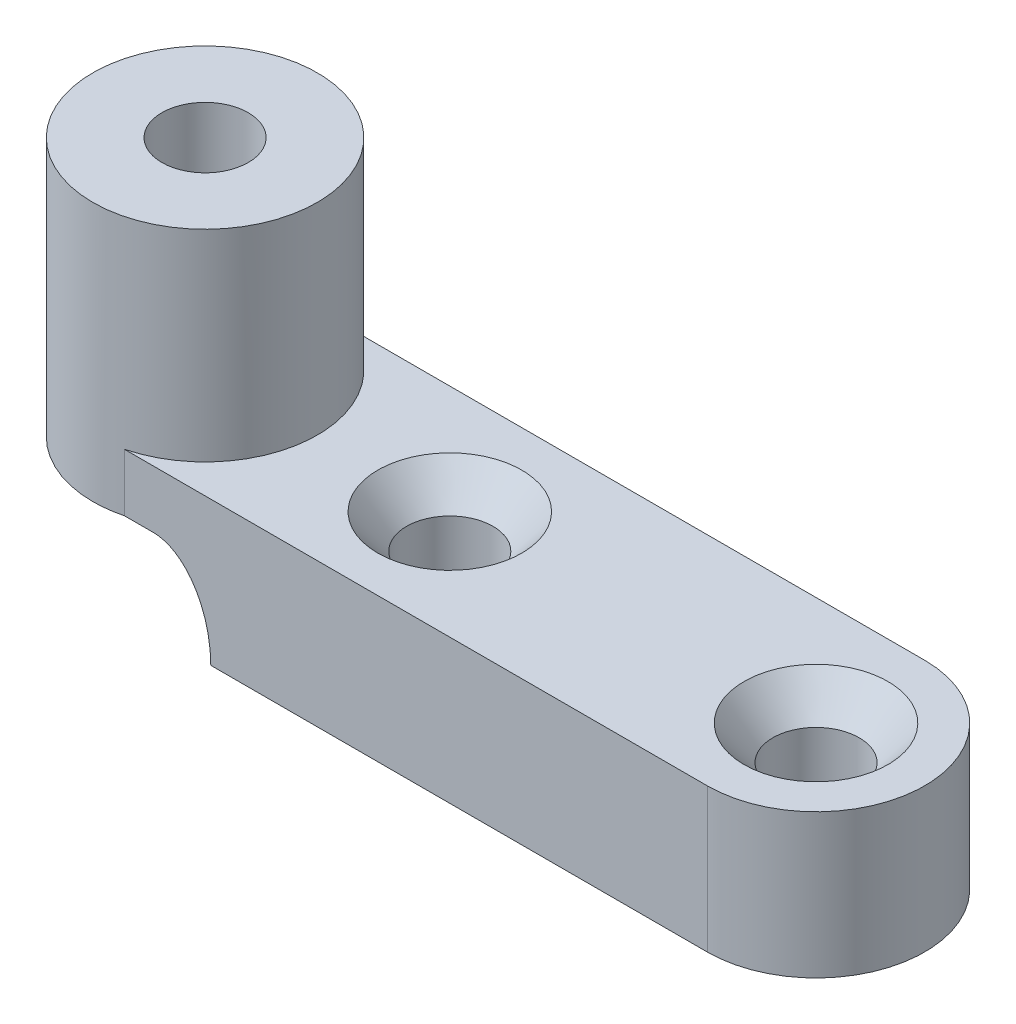
ISO-10303-21;
HEADER;
FILE_DESCRIPTION(('STEP AP214'),'2;1');
FILE_NAME('part.step','',(''),(''),'','','');
FILE_SCHEMA(('AUTOMOTIVE_DESIGN { 1 0 10303 214 1 1 1 1 }'));
ENDSEC;
DATA;
#1=APPLICATION_CONTEXT('core data for automotive mechanical design processes');
#2=APPLICATION_PROTOCOL_DEFINITION('international standard','automotive_design',2000,#1);
#3=PRODUCT_CONTEXT('',#1,'mechanical');
#4=PRODUCT('Part','Part','',(#3));
#5=PRODUCT_RELATED_PRODUCT_CATEGORY('part','',(#4));
#6=PRODUCT_DEFINITION_FORMATION('','',#4);
#7=PRODUCT_DEFINITION_CONTEXT('part definition',#1,'design');
#8=PRODUCT_DEFINITION('design','',#6,#7);
#9=PRODUCT_DEFINITION_SHAPE('','',#8);
#10=(LENGTH_UNIT() NAMED_UNIT(*) SI_UNIT(.MILLI.,.METRE.));
#11=(NAMED_UNIT(*) PLANE_ANGLE_UNIT() SI_UNIT($,.RADIAN.));
#12=(NAMED_UNIT(*) SI_UNIT($,.STERADIAN.) SOLID_ANGLE_UNIT());
#13=UNCERTAINTY_MEASURE_WITH_UNIT(LENGTH_MEASURE(1.E-05),#10,'distance_accuracy_value','');
#14=(GEOMETRIC_REPRESENTATION_CONTEXT(3) GLOBAL_UNCERTAINTY_ASSIGNED_CONTEXT((#13)) GLOBAL_UNIT_ASSIGNED_CONTEXT((#10,
#11,#12)) REPRESENTATION_CONTEXT('',''));
#15=CARTESIAN_POINT('',(0.,0.,0.));
#16=DIRECTION('',(0.,0.,1.));
#17=DIRECTION('',(1.,0.,0.));
#18=AXIS2_PLACEMENT_3D('',#15,#16,#17);
#19=CARTESIAN_POINT('',(-5.,4.5,0.));
#20=DIRECTION('',(0.,1.,0.));
#21=DIRECTION('',(0.,0.,1.));
#22=AXIS2_PLACEMENT_3D('',#19,#20,#21);
#23=CYLINDRICAL_SURFACE('',#22,3.9);
#24=CARTESIAN_POINT('',(-5.,16.5,0.));
#25=DIRECTION('',(0.,1.,0.));
#26=DIRECTION('',(0.,0.,1.));
#27=AXIS2_PLACEMENT_3D('',#24,#25,#26);
#28=CIRCLE('',#27,3.9);
#29=CARTESIAN_POINT('',(-5.,16.5,3.9));
#30=VERTEX_POINT('',#29);
#31=EDGE_CURVE('E146',#30,#30,#28,.T.);
#32=ORIENTED_EDGE('',*,*,#31,.F.);
#33=EDGE_LOOP('',(#32));
#34=FACE_BOUND('',#33,.T.);
#35=DIRECTION('',(0.,1.,0.));
#36=VECTOR('',#35,1.);
#37=CARTESIAN_POINT('',(-4.02530833455306,-12.3797583153918,-3.77623836076436));
#38=LINE('',#37,#36);
#39=CARTESIAN_POINT('',(-4.02530833455306,7.5,-3.77623836076436));
#40=VERTEX_POINT('',#39);
#41=CARTESIAN_POINT('',(-4.02530833455306,9.5,-3.77623836076436));
#42=VERTEX_POINT('',#41);
#43=EDGE_CURVE('E136',#40,#42,#38,.T.);
#44=ORIENTED_EDGE('',*,*,#43,.F.);
#45=CARTESIAN_POINT('',(-5.,7.5,0.));
#46=DIRECTION('',(0.,-1.,0.));
#47=DIRECTION('',(0.,0.,-1.));
#48=AXIS2_PLACEMENT_3D('',#45,#46,#47);
#49=CIRCLE('',#48,3.9);
#50=CARTESIAN_POINT('',(-4.02530833455306,7.5,3.77623836076436));
#51=VERTEX_POINT('',#50);
#52=EDGE_CURVE('E121',#51,#40,#49,.T.);
#53=ORIENTED_EDGE('',*,*,#52,.F.);
#54=DIRECTION('',(0.,1.,0.));
#55=VECTOR('',#54,1.);
#56=CARTESIAN_POINT('',(-4.02530833455306,-12.3797583153918,3.77623836076436));
#57=LINE('',#56,#55);
#58=CARTESIAN_POINT('',(-4.02530833455306,9.5,3.77623836076436));
#59=VERTEX_POINT('',#58);
#60=EDGE_CURVE('E134',#51,#59,#57,.T.);
#61=ORIENTED_EDGE('',*,*,#60,.T.);
#62=CARTESIAN_POINT('',(-5.,9.5,0.));
#63=DIRECTION('',(0.,1.,0.));
#64=DIRECTION('',(0.,0.,1.));
#65=AXIS2_PLACEMENT_3D('',#62,#63,#64);
#66=CIRCLE('',#65,3.9);
#67=EDGE_CURVE('E154',#59,#42,#66,.T.);
#68=ORIENTED_EDGE('',*,*,#67,.T.);
#69=EDGE_LOOP('',(#44,#53,#61,#68));
#70=FACE_BOUND('',#69,.T.);
#71=ADVANCED_FACE('F45',(#34,#70),#23,.T.);
#72=CARTESIAN_POINT('',(-5.,20.7426406871193,0.));
#73=DIRECTION('',(0.,-1.,0.));
#74=DIRECTION('',(0.,0.,-1.));
#75=AXIS2_PLACEMENT_3D('',#72,#73,#74);
#76=CYLINDRICAL_SURFACE('',#75,1.5);
#77=CARTESIAN_POINT('',(-5.,8.69175359259421,0.));
#78=DIRECTION('',(0.,-1.,0.));
#79=DIRECTION('',(0.,0.,-1.));
#80=AXIS2_PLACEMENT_3D('',#77,#78,#79);
#81=CIRCLE('',#80,1.5);
#82=CARTESIAN_POINT('',(-5.,8.69175359259421,-1.5));
#83=VERTEX_POINT('',#82);
#84=EDGE_CURVE('E175',#83,#83,#81,.T.);
#85=ORIENTED_EDGE('',*,*,#84,.T.);
#86=EDGE_LOOP('',(#85));
#87=FACE_BOUND('',#86,.T.);
#88=CARTESIAN_POINT('',(-5.,16.5,0.));
#89=DIRECTION('',(0.,1.,0.));
#90=DIRECTION('',(0.,0.,1.));
#91=AXIS2_PLACEMENT_3D('',#88,#89,#90);
#92=CIRCLE('',#91,1.5);
#93=CARTESIAN_POINT('',(-5.,16.5,1.5));
#94=VERTEX_POINT('',#93);
#95=EDGE_CURVE('E143',#94,#94,#92,.F.);
#96=ORIENTED_EDGE('',*,*,#95,.F.);
#97=EDGE_LOOP('',(#96));
#98=FACE_BOUND('',#97,.T.);
#99=ADVANCED_FACE('F375',(#87,#98),#76,.F.);
#100=CARTESIAN_POINT('',(-5.,4.5,0.));
#101=DIRECTION('',(0.,1.,0.));
#102=DIRECTION('',(0.,0.,1.));
#103=AXIS2_PLACEMENT_3D('',#100,#101,#102);
#104=PLANE('',#103);
#105=DIRECTION('',(1.,0.,0.));
#106=VECTOR('',#105,1.);
#107=CARTESIAN_POINT('',(0.,4.5,3.77623836076436));
#108=LINE('',#107,#106);
#109=CARTESIAN_POINT('',(-1.02530833455306,4.5,3.77623836076436));
#110=VERTEX_POINT('',#109);
#111=CARTESIAN_POINT('',(16.22,4.5,3.77623836076436));
#112=VERTEX_POINT('',#111);
#113=EDGE_CURVE('E148',#110,#112,#108,.T.);
#114=ORIENTED_EDGE('',*,*,#113,.F.);
#115=CARTESIAN_POINT('',(-1.02530833455306,4.5,-4.1538621968408));
#116=CARTESIAN_POINT('',(-1.02530833455306,4.5,-1.38462073228026));
#117=CARTESIAN_POINT('',(-1.02530833455306,4.5,1.38462073228026));
#118=CARTESIAN_POINT('',(-1.02530833455306,4.5,4.15386219684079));
#119=(BOUNDED_CURVE() B_SPLINE_CURVE(3,(#115,#116,#117,#118),.UNSPECIFIED.,.F.,
.F.) B_SPLINE_CURVE_WITH_KNOTS((4,4),(-0.00415386219684079,0.00415386219684079),
.UNSPECIFIED.) CURVE() GEOMETRIC_REPRESENTATION_ITEM() RATIONAL_B_SPLINE_CURVE((1.,1.,1.,1.)) REPRESENTATION_ITEM(''));
#120=CARTESIAN_POINT('',(-1.02530833455306,4.5,1.53316431813513));
#121=VERTEX_POINT('',#120);
#122=EDGE_CURVE('E66',#121,#110,#119,.T.);
#123=ORIENTED_EDGE('',*,*,#122,.F.);
#124=DIRECTION('',(0.,0.,1.));
#125=VECTOR('',#124,1.);
#126=CARTESIAN_POINT('',(-1.02530833455306,4.5,3.77623836076436));
#127=LINE('',#126,#125);
#128=CARTESIAN_POINT('',(-1.02530833455306,4.5,-1.53316431813892));
#129=VERTEX_POINT('',#128);
#130=EDGE_CURVE('E183',#129,#121,#127,.T.);
#131=ORIENTED_EDGE('',*,*,#130,.F.);
#132=CARTESIAN_POINT('',(-1.02530833455306,4.5,-4.1538621968408));
#133=CARTESIAN_POINT('',(-1.02530833455306,4.5,-1.38462073228026));
#134=CARTESIAN_POINT('',(-1.02530833455306,4.5,1.38462073228026));
#135=CARTESIAN_POINT('',(-1.02530833455306,4.5,4.15386219684079));
#136=(BOUNDED_CURVE() B_SPLINE_CURVE(3,(#132,#133,#134,#135),.UNSPECIFIED.,.F.,
.F.) B_SPLINE_CURVE_WITH_KNOTS((4,4),(-0.00415386219684079,0.00415386219684079),
.UNSPECIFIED.) CURVE() GEOMETRIC_REPRESENTATION_ITEM() RATIONAL_B_SPLINE_CURVE((1.,1.,1.,1.)) REPRESENTATION_ITEM(''));
#137=CARTESIAN_POINT('',(-1.02530833455306,4.5,-3.77623836076436));
#138=VERTEX_POINT('',#137);
#139=EDGE_CURVE('E129',#138,#129,#136,.T.);
#140=ORIENTED_EDGE('',*,*,#139,.F.);
#141=DIRECTION('',(-1.,0.,0.));
#142=VECTOR('',#141,1.);
#143=CARTESIAN_POINT('',(0.,4.5,-3.77623836076436));
#144=LINE('',#143,#142);
#145=CARTESIAN_POINT('',(16.22,4.50000000000001,-3.77623836076436));
#146=VERTEX_POINT('',#145);
#147=EDGE_CURVE('E239',#146,#138,#144,.T.);
#148=ORIENTED_EDGE('',*,*,#147,.F.);
#149=CARTESIAN_POINT('',(16.22,4.5,0.));
#150=DIRECTION('',(0.,1.,0.));
#151=DIRECTION('',(0.,0.,1.));
#152=AXIS2_PLACEMENT_3D('',#149,#150,#151);
#153=CIRCLE('',#152,3.77623836076436);
#154=EDGE_CURVE('E180',#146,#112,#153,.F.);
#155=ORIENTED_EDGE('',*,*,#154,.T.);
#156=EDGE_LOOP('',(#114,#123,#131,#140,#148,#155));
#157=FACE_BOUND('',#156,.T.);
#158=CARTESIAN_POINT('',(3.5,4.5,0.));
#159=DIRECTION('',(0.,1.,0.));
#160=DIRECTION('',(0.,0.,1.));
#161=AXIS2_PLACEMENT_3D('',#158,#159,#160);
#162=CIRCLE('',#161,1.5);
#163=CARTESIAN_POINT('',(3.5,4.5,1.5));
#164=VERTEX_POINT('',#163);
#165=EDGE_CURVE('E415',#164,#164,#162,.F.);
#166=ORIENTED_EDGE('',*,*,#165,.F.);
#167=EDGE_LOOP('',(#166));
#168=FACE_BOUND('',#167,.T.);
#169=CARTESIAN_POINT('',(16.22,4.5,0.));
#170=DIRECTION('',(0.,1.,0.));
#171=DIRECTION('',(0.,0.,1.));
#172=AXIS2_PLACEMENT_3D('',#169,#170,#171);
#173=CIRCLE('',#172,1.5);
#174=CARTESIAN_POINT('',(16.22,4.5,1.5));
#175=VERTEX_POINT('',#174);
#176=EDGE_CURVE('E411',#175,#175,#173,.F.);
#177=ORIENTED_EDGE('',*,*,#176,.F.);
#178=EDGE_LOOP('',(#177));
#179=FACE_BOUND('',#178,.T.);
#180=ADVANCED_FACE('F319',(#157,#168,#179),#104,.F.);
#181=CARTESIAN_POINT('',(12.72,9.5,0.));
#182=DIRECTION('',(0.,1.,0.));
#183=DIRECTION('',(0.,0.,1.));
#184=AXIS2_PLACEMENT_3D('',#181,#182,#183);
#185=PLANE('',#184);
#186=CARTESIAN_POINT('',(3.5,9.5,0.));
#187=DIRECTION('',(0.,1.,0.));
#188=DIRECTION('',(0.,0.,1.));
#189=AXIS2_PLACEMENT_3D('',#186,#187,#188);
#190=CIRCLE('',#189,2.5);
#191=CARTESIAN_POINT('',(3.5,9.5,2.5));
#192=VERTEX_POINT('',#191);
#193=EDGE_CURVE('E160',#192,#192,#190,.T.);
#194=ORIENTED_EDGE('',*,*,#193,.F.);
#195=EDGE_LOOP('',(#194));
#196=FACE_BOUND('',#195,.T.);
#197=CARTESIAN_POINT('',(16.22,9.5,0.));
#198=DIRECTION('',(0.,1.,0.));
#199=DIRECTION('',(0.,0.,1.));
#200=AXIS2_PLACEMENT_3D('',#197,#198,#199);
#201=CIRCLE('',#200,2.5);
#202=CARTESIAN_POINT('',(16.22,9.5,2.5));
#203=VERTEX_POINT('',#202);
#204=EDGE_CURVE('E408',#203,#203,#201,.T.);
#205=ORIENTED_EDGE('',*,*,#204,.F.);
#206=EDGE_LOOP('',(#205));
#207=FACE_BOUND('',#206,.T.);
#208=ORIENTED_EDGE('',*,*,#67,.F.);
#209=DIRECTION('',(-1.,0.,0.));
#210=VECTOR('',#209,1.);
#211=CARTESIAN_POINT('',(0.,9.5,3.77623836076436));
#212=LINE('',#211,#210);
#213=CARTESIAN_POINT('',(16.22,9.5,3.77623836076436));
#214=VERTEX_POINT('',#213);
#215=EDGE_CURVE('E142',#214,#59,#212,.T.);
#216=ORIENTED_EDGE('',*,*,#215,.F.);
#217=CARTESIAN_POINT('',(16.22,9.5,0.));
#218=DIRECTION('',(0.,1.,0.));
#219=DIRECTION('',(0.,0.,1.));
#220=AXIS2_PLACEMENT_3D('',#217,#218,#219);
#221=CIRCLE('',#220,3.77623836076436);
#222=CARTESIAN_POINT('',(16.22,9.5,-3.77623836076436));
#223=VERTEX_POINT('',#222);
#224=EDGE_CURVE('E163',#223,#214,#221,.F.);
#225=ORIENTED_EDGE('',*,*,#224,.F.);
#226=DIRECTION('',(1.,0.,0.));
#227=VECTOR('',#226,1.);
#228=CARTESIAN_POINT('',(0.,9.5,-3.77623836076436));
#229=LINE('',#228,#227);
#230=EDGE_CURVE('E399',#42,#223,#229,.T.);
#231=ORIENTED_EDGE('',*,*,#230,.F.);
#232=EDGE_LOOP('',(#208,#216,#225,#231));
#233=FACE_BOUND('',#232,.T.);
#234=ADVANCED_FACE('F286',(#196,#207,#233),#185,.T.);
#235=CARTESIAN_POINT('',(-5.,16.5,0.));
#236=DIRECTION('',(0.,1.,0.));
#237=DIRECTION('',(0.,0.,1.));
#238=AXIS2_PLACEMENT_3D('',#235,#236,#237);
#239=PLANE('',#238);
#240=ORIENTED_EDGE('',*,*,#95,.T.);
#241=EDGE_LOOP('',(#240));
#242=FACE_BOUND('',#241,.T.);
#243=ORIENTED_EDGE('',*,*,#31,.T.);
#244=EDGE_LOOP('',(#243));
#245=FACE_BOUND('',#244,.T.);
#246=ADVANCED_FACE('F386',(#242,#245),#239,.T.);
#247=CARTESIAN_POINT('',(0.,-20.6808381565139,-3.77623836076436));
#248=DIRECTION('',(0.,0.,1.));
#249=DIRECTION('',(1.,0.,0.));
#250=AXIS2_PLACEMENT_3D('',#247,#248,#249);
#251=PLANE('',#250);
#252=ORIENTED_EDGE('',*,*,#147,.T.);
#253=CARTESIAN_POINT('',(-3.02530833455306,7.5,-3.77623836076436));
#254=CARTESIAN_POINT('',(-1.02530833455306,7.5,-3.77623836076436));
#255=CARTESIAN_POINT('',(-1.02530833455306,4.5,-3.77623836076436));
#256=(BOUNDED_CURVE() B_SPLINE_CURVE(2,(#253,#254,#255),.UNSPECIFIED.,.F.,
.F.) B_SPLINE_CURVE_WITH_KNOTS((3,3),(0.,1.),
.UNSPECIFIED.) CURVE() GEOMETRIC_REPRESENTATION_ITEM() RATIONAL_B_SPLINE_CURVE((1.,
0.707106781186548,1.)) REPRESENTATION_ITEM(''));
#257=CARTESIAN_POINT('',(-3.02530833455306,7.5,-3.77623836076436));
#258=VERTEX_POINT('',#257);
#259=EDGE_CURVE('E12',#138,#258,#256,.F.);
#260=ORIENTED_EDGE('',*,*,#259,.T.);
#261=DIRECTION('',(1.,0.,0.));
#262=VECTOR('',#261,1.);
#263=CARTESIAN_POINT('',(-1.02530833455306,7.5,-3.77623836076436));
#264=LINE('',#263,#262);
#265=EDGE_CURVE('E137',#40,#258,#264,.T.);
#266=ORIENTED_EDGE('',*,*,#265,.F.);
#267=ORIENTED_EDGE('',*,*,#43,.T.);
#268=ORIENTED_EDGE('',*,*,#230,.T.);
#269=DIRECTION('',(0.,1.,0.));
#270=VECTOR('',#269,1.);
#271=CARTESIAN_POINT('',(16.22,-20.6808381565139,-3.77623836076436));
#272=LINE('',#271,#270);
#273=EDGE_CURVE('E397',#146,#223,#272,.T.);
#274=ORIENTED_EDGE('',*,*,#273,.F.);
#275=EDGE_LOOP('',(#252,#260,#266,#267,#268,#274));
#276=FACE_BOUND('',#275,.T.);
#277=ADVANCED_FACE('F227',(#276),#251,.F.);
#278=CARTESIAN_POINT('',(0.,-20.6808381565139,3.77623836076436));
#279=DIRECTION('',(0.,0.,-1.));
#280=DIRECTION('',(-1.,0.,0.));
#281=AXIS2_PLACEMENT_3D('',#278,#279,#280);
#282=PLANE('',#281);
#283=DIRECTION('',(-1.,0.,0.));
#284=VECTOR('',#283,1.);
#285=CARTESIAN_POINT('',(-4.02530833455306,7.5,3.77623836076436));
#286=LINE('',#285,#284);
#287=CARTESIAN_POINT('',(-3.02530833455306,7.5,3.77623836076436));
#288=VERTEX_POINT('',#287);
#289=EDGE_CURVE('E117',#288,#51,#286,.T.);
#290=ORIENTED_EDGE('',*,*,#289,.F.);
#291=CARTESIAN_POINT('',(-1.02530833455306,4.5,3.77623836076435));
#292=CARTESIAN_POINT('',(-1.02530833455306,7.5,3.77623836076435));
#293=CARTESIAN_POINT('',(-3.02530833455306,7.5,3.77623836076436));
#294=(BOUNDED_CURVE() B_SPLINE_CURVE(2,(#291,#292,#293),.UNSPECIFIED.,.F.,
.F.) B_SPLINE_CURVE_WITH_KNOTS((3,3),(0.,1.),
.UNSPECIFIED.) CURVE() GEOMETRIC_REPRESENTATION_ITEM() RATIONAL_B_SPLINE_CURVE((1.,
0.707106781186548,1.)) REPRESENTATION_ITEM(''));
#295=EDGE_CURVE('E59',#288,#110,#294,.F.);
#296=ORIENTED_EDGE('',*,*,#295,.T.);
#297=ORIENTED_EDGE('',*,*,#113,.T.);
#298=DIRECTION('',(0.,1.,0.));
#299=VECTOR('',#298,1.);
#300=CARTESIAN_POINT('',(16.22,-20.6808381565139,3.77623836076436));
#301=LINE('',#300,#299);
#302=EDGE_CURVE('E255',#112,#214,#301,.T.);
#303=ORIENTED_EDGE('',*,*,#302,.T.);
#304=ORIENTED_EDGE('',*,*,#215,.T.);
#305=ORIENTED_EDGE('',*,*,#60,.F.);
#306=EDGE_LOOP('',(#290,#296,#297,#303,#304,#305));
#307=FACE_BOUND('',#306,.T.);
#308=ADVANCED_FACE('F140',(#307),#282,.F.);
#309=CARTESIAN_POINT('',(16.22,-20.6808381565139,0.));
#310=DIRECTION('',(0.,1.,0.));
#311=DIRECTION('',(0.,0.,1.));
#312=AXIS2_PLACEMENT_3D('',#309,#310,#311);
#313=CYLINDRICAL_SURFACE('',#312,3.77623836076436);
#314=ORIENTED_EDGE('',*,*,#302,.F.);
#315=ORIENTED_EDGE('',*,*,#154,.F.);
#316=ORIENTED_EDGE('',*,*,#273,.T.);
#317=ORIENTED_EDGE('',*,*,#224,.T.);
#318=EDGE_LOOP('',(#314,#315,#316,#317));
#319=FACE_BOUND('',#318,.T.);
#320=ADVANCED_FACE('F222',(#319),#313,.T.);
#321=CARTESIAN_POINT('',(16.22,-20.6808381565139,0.));
#322=DIRECTION('',(0.,1.,0.));
#323=DIRECTION('',(0.,0.,1.));
#324=AXIS2_PLACEMENT_3D('',#321,#322,#323);
#325=CYLINDRICAL_SURFACE('',#324,1.5);
#326=ORIENTED_EDGE('',*,*,#176,.T.);
#327=EDGE_LOOP('',(#326));
#328=FACE_BOUND('',#327,.T.);
#329=CARTESIAN_POINT('',(16.22,8.30824640740579,0.));
#330=DIRECTION('',(0.,1.,0.));
#331=DIRECTION('',(0.,0.,1.));
#332=AXIS2_PLACEMENT_3D('',#329,#330,#331);
#333=CIRCLE('',#332,1.5);
#334=CARTESIAN_POINT('',(16.22,8.30824640740579,1.5));
#335=VERTEX_POINT('',#334);
#336=EDGE_CURVE('E159',#335,#335,#333,.T.);
#337=ORIENTED_EDGE('',*,*,#336,.T.);
#338=EDGE_LOOP('',(#337));
#339=FACE_BOUND('',#338,.T.);
#340=ADVANCED_FACE('F218',(#328,#339),#325,.F.);
#341=CARTESIAN_POINT('',(3.5,16.5,0.));
#342=DIRECTION('',(0.,-1.,0.));
#343=DIRECTION('',(0.,0.,-1.));
#344=AXIS2_PLACEMENT_3D('',#341,#342,#343);
#345=CYLINDRICAL_SURFACE('',#344,1.5);
#346=ORIENTED_EDGE('',*,*,#165,.T.);
#347=EDGE_LOOP('',(#346));
#348=FACE_BOUND('',#347,.T.);
#349=CARTESIAN_POINT('',(3.5,8.30824640740579,0.));
#350=DIRECTION('',(0.,1.,0.));
#351=DIRECTION('',(0.,0.,1.));
#352=AXIS2_PLACEMENT_3D('',#349,#350,#351);
#353=CIRCLE('',#352,1.5);
#354=CARTESIAN_POINT('',(3.5,8.30824640740579,1.5));
#355=VERTEX_POINT('',#354);
#356=EDGE_CURVE('E156',#355,#355,#353,.T.);
#357=ORIENTED_EDGE('',*,*,#356,.T.);
#358=EDGE_LOOP('',(#357));
#359=FACE_BOUND('',#358,.T.);
#360=ADVANCED_FACE('F211',(#348,#359),#345,.F.);
#361=CARTESIAN_POINT('',(3.5,9.5,0.));
#362=DIRECTION('',(0.,1.,0.));
#363=DIRECTION('',(0.,0.,1.));
#364=AXIS2_PLACEMENT_3D('',#361,#362,#363);
#365=CONICAL_SURFACE('',#364,2.5,0.698131700797732);
#366=ORIENTED_EDGE('',*,*,#193,.T.);
#367=EDGE_LOOP('',(#366));
#368=FACE_BOUND('',#367,.T.);
#369=ORIENTED_EDGE('',*,*,#356,.F.);
#370=EDGE_LOOP('',(#369));
#371=FACE_BOUND('',#370,.T.);
#372=ADVANCED_FACE('F207',(#368,#371),#365,.F.);
#373=CARTESIAN_POINT('',(16.22,9.5,0.));
#374=DIRECTION('',(0.,1.,0.));
#375=DIRECTION('',(0.,0.,1.));
#376=AXIS2_PLACEMENT_3D('',#373,#374,#375);
#377=CONICAL_SURFACE('',#376,2.5,0.698131700797732);
#378=ORIENTED_EDGE('',*,*,#204,.T.);
#379=EDGE_LOOP('',(#378));
#380=FACE_BOUND('',#379,.T.);
#381=ORIENTED_EDGE('',*,*,#336,.F.);
#382=EDGE_LOOP('',(#381));
#383=FACE_BOUND('',#382,.T.);
#384=ADVANCED_FACE('F210',(#380,#383),#377,.F.);
#385=CARTESIAN_POINT('',(-5.,7.5,0.));
#386=DIRECTION('',(0.,-1.,0.));
#387=DIRECTION('',(0.,0.,-1.));
#388=AXIS2_PLACEMENT_3D('',#385,#386,#387);
#389=PLANE('',#388);
#390=ORIENTED_EDGE('',*,*,#265,.T.);
#391=CARTESIAN_POINT('',(-3.02530833455306,7.5,4.15386219684079));
#392=CARTESIAN_POINT('',(-3.02530833455306,7.5,1.38462073228027));
#393=CARTESIAN_POINT('',(-3.02530833455306,7.5,-1.38462073228027));
#394=CARTESIAN_POINT('',(-3.02530833455306,7.5,-4.15386219684079));
#395=(BOUNDED_CURVE() B_SPLINE_CURVE(3,(#391,#392,#393,#394),.UNSPECIFIED.,.F.,
.F.) B_SPLINE_CURVE_WITH_KNOTS((4,4),(-0.00415386219684079,0.00415386219684079),
.UNSPECIFIED.) CURVE() GEOMETRIC_REPRESENTATION_ITEM() RATIONAL_B_SPLINE_CURVE((1.,1.,1.,1.)) REPRESENTATION_ITEM(''));
#396=CARTESIAN_POINT('',(-3.02530833455306,7.5,-1.53316431813892));
#397=VERTEX_POINT('',#396);
#398=EDGE_CURVE('E315',#258,#397,#395,.F.);
#399=ORIENTED_EDGE('',*,*,#398,.T.);
#400=CARTESIAN_POINT('',(-5.,7.5,0.));
#401=DIRECTION('',(0.,-1.,0.));
#402=DIRECTION('',(0.,0.,-1.));
#403=AXIS2_PLACEMENT_3D('',#400,#401,#402);
#404=CIRCLE('',#403,2.5);
#405=CARTESIAN_POINT('',(-3.02530833455122,7.5,1.53316431813656));
#406=VERTEX_POINT('',#405);
#407=EDGE_CURVE('E166',#406,#397,#404,.T.);
#408=ORIENTED_EDGE('',*,*,#407,.F.);
#409=CARTESIAN_POINT('',(-3.02530833455306,7.5,4.15386219684079));
#410=CARTESIAN_POINT('',(-3.02530833455306,7.5,1.38462073228027));
#411=CARTESIAN_POINT('',(-3.02530833455306,7.5,-1.38462073228027));
#412=CARTESIAN_POINT('',(-3.02530833455306,7.5,-4.15386219684079));
#413=(BOUNDED_CURVE() B_SPLINE_CURVE(3,(#409,#410,#411,#412),.UNSPECIFIED.,.F.,
.F.) B_SPLINE_CURVE_WITH_KNOTS((4,4),(-0.00415386219684079,0.00415386219684079),
.UNSPECIFIED.) CURVE() GEOMETRIC_REPRESENTATION_ITEM() RATIONAL_B_SPLINE_CURVE((1.,1.,1.,1.)) REPRESENTATION_ITEM(''));
#414=EDGE_CURVE('E124',#406,#288,#413,.F.);
#415=ORIENTED_EDGE('',*,*,#414,.T.);
#416=ORIENTED_EDGE('',*,*,#289,.T.);
#417=ORIENTED_EDGE('',*,*,#52,.T.);
#418=EDGE_LOOP('',(#390,#399,#408,#415,#416,#417));
#419=FACE_BOUND('',#418,.T.);
#420=ADVANCED_FACE('F120',(#419),#389,.T.);
#421=CARTESIAN_POINT('',(-1.02530833455306,7.5,3.77623836076436));
#422=DIRECTION('',(1.,0.,0.));
#423=DIRECTION('',(0.,0.,-1.));
#424=AXIS2_PLACEMENT_3D('',#421,#422,#423);
#425=PLANE('',#424);
#426=ORIENTED_EDGE('',*,*,#130,.T.);
#427=CARTESIAN_POINT('',(-1.02530833455306,4.5,-1.53316431813893));
#428=CARTESIAN_POINT('',(-1.02530833455306,4.50000001259159,-1.27789585911693));
#429=CARTESIAN_POINT('',(-1.02530833455306,4.51251548656184,-1.02225709268332));
#430=CARTESIAN_POINT('',(-1.02530833455306,4.53624009274957,-0.511251555337727));
#431=CARTESIAN_POINT('',(-1.02530833455306,4.54634679743888,-0.255732313647759));
#432=CARTESIAN_POINT('',(-1.02530833455306,4.54635224277591,0.255495783791259));
#433=CARTESIAN_POINT('',(-1.02530833455306,4.53624262009849,0.511204718014428));
#434=CARTESIAN_POINT('',(-1.02530833455306,4.5124966282323,1.0226556784002));
#435=CARTESIAN_POINT('',(-1.02530833455306,4.5000000126691,1.27843191438391));
#436=CARTESIAN_POINT('',(-1.02530833455306,4.5,1.53316431813513));
#437=(BOUNDED_CURVE() B_SPLINE_CURVE(3,(#427,#428,#429,#430,#431,#432,#433,#434,#435,#436),
.UNSPECIFIED.,.F.,.F.) B_SPLINE_CURVE_WITH_KNOTS((4,2,2,2,4),(0.00522941678210396,
0.00599195220881027,0.00675448763551659,0.00751702306222291,0.00827955848892922),
.UNSPECIFIED.) CURVE() GEOMETRIC_REPRESENTATION_ITEM() RATIONAL_B_SPLINE_CURVE((1.,1.,1.,1.,1.,
1.,1.,1.,1.,1.)) REPRESENTATION_ITEM(''));
#438=EDGE_CURVE('E73',#121,#129,#437,.F.);
#439=ORIENTED_EDGE('',*,*,#438,.T.);
#440=EDGE_LOOP('',(#426,#439));
#441=FACE_BOUND('',#440,.T.);
#442=ADVANCED_FACE('F195',(#441),#425,.F.);
#443=CARTESIAN_POINT('',(-5.,7.5,0.));
#444=DIRECTION('',(0.,-1.,0.));
#445=DIRECTION('',(0.,0.,-1.));
#446=AXIS2_PLACEMENT_3D('',#443,#444,#445);
#447=CONICAL_SURFACE('',#446,2.5,0.698131700797732);
#448=CARTESIAN_POINT('',(-3.02530833455122,7.5,1.53316431813655));
#449=CARTESIAN_POINT('',(-2.90284833218694,7.5,1.37543780175172));
#450=CARTESIAN_POINT('',(-2.77143499603631,7.50000000000011,1.16732125768141));
#451=CARTESIAN_POINT('',(-2.5677404510347,7.49999999999989,0.642848482098354));
#452=CARTESIAN_POINT('',(-2.49998062329556,7.5,0.323462839934523));
#453=CARTESIAN_POINT('',(-2.50001938567157,7.5,-0.323762291565648));
#454=CARTESIAN_POINT('',(-2.56777327202788,7.50000000000011,-0.64287287923624));
#455=CARTESIAN_POINT('',(-2.7712620946296,7.49999999999989,-1.16693614017168));
#456=CARTESIAN_POINT('',(-2.9025702101189,7.5,-1.37507958533106));
#457=CARTESIAN_POINT('',(-3.02530833455306,7.5,-1.53316431813892));
#458=(BOUNDED_CURVE() B_SPLINE_CURVE(3,(#448,#449,#450,#451,#452,#453,#454,#455,#456,#457),
.UNSPECIFIED.,.F.,.F.) B_SPLINE_CURVE_WITH_KNOTS((4,2,2,2,4),(0.00522941678210396,
0.00599195220881027,0.00675448763551659,0.00751702306222291,0.00827955848892922),
.UNSPECIFIED.) CURVE() GEOMETRIC_REPRESENTATION_ITEM() RATIONAL_B_SPLINE_CURVE((1.,1.,1.,1.,1.,
1.,1.,1.,1.,1.)) REPRESENTATION_ITEM(''));
#459=EDGE_CURVE('E168',#397,#406,#458,.F.);
#460=ORIENTED_EDGE('',*,*,#459,.T.);
#461=ORIENTED_EDGE('',*,*,#407,.T.);
#462=EDGE_LOOP('',(#460,#461));
#463=FACE_BOUND('',#462,.T.);
#464=ORIENTED_EDGE('',*,*,#84,.F.);
#465=EDGE_LOOP('',(#464));
#466=FACE_BOUND('',#465,.T.);
#467=ADVANCED_FACE('F204',(#463,#466),#447,.F.);
#468=CARTESIAN_POINT('',(-3.02530833455306,7.5,-4.15386219684079));
#469=CARTESIAN_POINT('',(-3.02530833455306,7.5,-1.38462073228027));
#470=CARTESIAN_POINT('',(-3.02530833455306,7.5,1.38462073228027));
#471=CARTESIAN_POINT('',(-3.02530833455306,7.5,4.15386219684079));
#472=CARTESIAN_POINT('',(-1.02530833455306,7.5,-4.1538621968408));
#473=CARTESIAN_POINT('',(-1.02530833455306,7.5,-1.38462073228026));
#474=CARTESIAN_POINT('',(-1.02530833455306,7.5,1.38462073228026));
#475=CARTESIAN_POINT('',(-1.02530833455306,7.5,4.15386219684079));
#476=CARTESIAN_POINT('',(-1.02530833455306,4.5,-4.1538621968408));
#477=CARTESIAN_POINT('',(-1.02530833455306,4.5,-1.38462073228026));
#478=CARTESIAN_POINT('',(-1.02530833455306,4.5,1.38462073228026));
#479=CARTESIAN_POINT('',(-1.02530833455306,4.5,4.15386219684079));
#480=(BOUNDED_SURFACE() B_SPLINE_SURFACE(2,3,((#468,#469,#470,#471),(#472,#473,#474,#475),(#476,
#477,#478,#479)),.UNSPECIFIED.,.F.,.F.,.F.) B_SPLINE_SURFACE_WITH_KNOTS((3,3),(4,4),(0.,1.),
(-0.00415386219684079,0.00415386219684079),
.UNSPECIFIED.) GEOMETRIC_REPRESENTATION_ITEM() RATIONAL_B_SPLINE_SURFACE(((1.,1.,1.,1.),
(0.707106781186548,0.707106781186548,0.707106781186548,0.707106781186548),(1.,1.,1.,1.))) REPRESENTATION_ITEM('') SURFACE());
#481=CARTESIAN_POINT('',(-1.02530833455306,4.5,1.53316431813513));
#482=CARTESIAN_POINT('',(-1.02530833455306,7.49999999999877,1.53316431813655));
#483=CARTESIAN_POINT('',(-3.02530833455122,7.5,1.53316431813655));
#484=(BOUNDED_CURVE() B_SPLINE_CURVE(2,(#481,#482,#483),.UNSPECIFIED.,.F.,
.F.) B_SPLINE_CURVE_WITH_KNOTS((3,3),(0.,1.),
.UNSPECIFIED.) CURVE() GEOMETRIC_REPRESENTATION_ITEM() RATIONAL_B_SPLINE_CURVE((1.,
0.707106781186764,1.)) REPRESENTATION_ITEM(''));
#485=EDGE_CURVE('E169',#121,#406,#484,.T.);
#486=ORIENTED_EDGE('',*,*,#295,.F.);
#487=ORIENTED_EDGE('',*,*,#414,.F.);
#488=ORIENTED_EDGE('',*,*,#485,.F.);
#489=ORIENTED_EDGE('',*,*,#122,.T.);
#490=EDGE_LOOP('',(#486,#487,#488,#489));
#491=FACE_BOUND('',#490,.T.);
#492=ADVANCED_FACE('F48',(#491),#480,.T.);
#493=CARTESIAN_POINT('',(-3.02530833455306,7.5,-1.53316431813892));
#494=CARTESIAN_POINT('',(-2.9025702101189,7.5,-1.37507958533106));
#495=CARTESIAN_POINT('',(-2.7712620946296,7.49999999999989,-1.16693614017168));
#496=CARTESIAN_POINT('',(-2.56777327202788,7.50000000000011,-0.64287287923624));
#497=CARTESIAN_POINT('',(-2.50001938567157,7.5,-0.323762291565648));
#498=CARTESIAN_POINT('',(-2.49998062329556,7.5,0.323462839934523));
#499=CARTESIAN_POINT('',(-2.5677404510347,7.49999999999989,0.642848482098354));
#500=CARTESIAN_POINT('',(-2.77143499603631,7.50000000000011,1.16732125768141));
#501=CARTESIAN_POINT('',(-2.90284833218694,7.5,1.37543780175172));
#502=CARTESIAN_POINT('',(-3.02530833455122,7.5,1.53316431813655));
#503=CARTESIAN_POINT('',(-1.02530833455306,7.5,-1.53316431813893));
#504=CARTESIAN_POINT('',(-1.02530833455301,7.41948907391537,-1.37761913831099));
#505=CARTESIAN_POINT('',(-1.02530833455298,7.34929475381825,-1.16357253109924));
#506=CARTESIAN_POINT('',(-1.02530833455314,7.25971763811526,-0.636018405155949));
#507=CARTESIAN_POINT('',(-1.02530833455306,7.2377318916261,-0.317722322929928));
#508=CARTESIAN_POINT('',(-1.02530833455306,7.2377186915551,0.317426712612434));
#509=CARTESIAN_POINT('',(-1.02530833455309,7.25970032287909,0.63599864342139));
#510=CARTESIAN_POINT('',(-1.02530833455303,7.34937662858828,1.1639699168046));
#511=CARTESIAN_POINT('',(-1.02530833455306,7.4196689437671,1.37796664191316));
#512=CARTESIAN_POINT('',(-1.02530833455306,7.49999999999877,1.53316431813655));
#513=CARTESIAN_POINT('',(-1.02530833455306,4.5,-1.53316431813893));
#514=CARTESIAN_POINT('',(-1.02530833455306,4.50000001259159,-1.27789585911693));
#515=CARTESIAN_POINT('',(-1.02530833455306,4.51251548656184,-1.02225709268332));
#516=CARTESIAN_POINT('',(-1.02530833455306,4.53624009274957,-0.511251555337727));
#517=CARTESIAN_POINT('',(-1.02530833455306,4.54634679743888,-0.255732313647759));
#518=CARTESIAN_POINT('',(-1.02530833455306,4.54635224277591,0.255495783791259));
#519=CARTESIAN_POINT('',(-1.02530833455306,4.53624262009849,0.511204718014428));
#520=CARTESIAN_POINT('',(-1.02530833455306,4.5124966282323,1.0226556784002));
#521=CARTESIAN_POINT('',(-1.02530833455306,4.5000000126691,1.27843191438391));
#522=CARTESIAN_POINT('',(-1.02530833455306,4.5,1.53316431813513));
#523=(BOUNDED_SURFACE() B_SPLINE_SURFACE(2,3,((#493,#494,#495,#496,#497,#498,#499,#500,#501,
#502),(#503,#504,#505,#506,#507,#508,#509,#510,#511,#512),(#513,#514,#515,#516,#517,#518,#519,
#520,#521,#522)),.UNSPECIFIED.,.F.,.F.,.F.) B_SPLINE_SURFACE_WITH_KNOTS((3,3),(4,2,2,2,4),(0.,
1.),(0.00522941678210396,0.00599195220881027,0.00675448763551659,0.00751702306222291,
0.00827955848892922),
.UNSPECIFIED.) GEOMETRIC_REPRESENTATION_ITEM() RATIONAL_B_SPLINE_SURFACE(((1.,1.,1.,1.,1.,1.,1.,
1.,1.,1.),(0.707106781186547,0.721595121507089,0.73652533743199,0.759199826989228,
0.766516900108018,0.766521114221589,0.75920360258222,0.736505952783294,0.721563515358373,
0.707106781186764),(1.,1.,1.,1.,1.,1.,1.,1.,1.,1.))) REPRESENTATION_ITEM('') SURFACE());
#524=CARTESIAN_POINT('',(-1.02530833455306,4.5,-1.53316431813892));
#525=CARTESIAN_POINT('',(-1.02530833455306,7.5,-1.53316431813892));
#526=CARTESIAN_POINT('',(-3.02530833455306,7.5,-1.53316431813892));
#527=(BOUNDED_CURVE() B_SPLINE_CURVE(2,(#524,#525,#526),.UNSPECIFIED.,.F.,
.F.) B_SPLINE_CURVE_WITH_KNOTS((3,3),(0.,1.),
.UNSPECIFIED.) CURVE() GEOMETRIC_REPRESENTATION_ITEM() RATIONAL_B_SPLINE_CURVE((1.,
0.707106781186548,1.)) REPRESENTATION_ITEM(''));
#528=EDGE_CURVE('E263',#129,#397,#527,.T.);
#529=ORIENTED_EDGE('',*,*,#485,.T.);
#530=ORIENTED_EDGE('',*,*,#459,.F.);
#531=ORIENTED_EDGE('',*,*,#528,.F.);
#532=ORIENTED_EDGE('',*,*,#438,.F.);
#533=EDGE_LOOP('',(#529,#530,#531,#532));
#534=FACE_BOUND('',#533,.T.);
#535=ADVANCED_FACE('F285',(#534),#523,.T.);
#536=CARTESIAN_POINT('',(-3.02530833455306,7.5,-4.15386219684079));
#537=CARTESIAN_POINT('',(-3.02530833455306,7.5,-1.38462073228027));
#538=CARTESIAN_POINT('',(-3.02530833455306,7.5,1.38462073228027));
#539=CARTESIAN_POINT('',(-3.02530833455306,7.5,4.15386219684079));
#540=CARTESIAN_POINT('',(-1.02530833455306,7.5,-4.1538621968408));
#541=CARTESIAN_POINT('',(-1.02530833455306,7.5,-1.38462073228026));
#542=CARTESIAN_POINT('',(-1.02530833455306,7.5,1.38462073228026));
#543=CARTESIAN_POINT('',(-1.02530833455306,7.5,4.15386219684079));
#544=CARTESIAN_POINT('',(-1.02530833455306,4.5,-4.1538621968408));
#545=CARTESIAN_POINT('',(-1.02530833455306,4.5,-1.38462073228026));
#546=CARTESIAN_POINT('',(-1.02530833455306,4.5,1.38462073228026));
#547=CARTESIAN_POINT('',(-1.02530833455306,4.5,4.15386219684079));
#548=(BOUNDED_SURFACE() B_SPLINE_SURFACE(2,3,((#536,#537,#538,#539),(#540,#541,#542,#543),(#544,
#545,#546,#547)),.UNSPECIFIED.,.F.,.F.,.F.) B_SPLINE_SURFACE_WITH_KNOTS((3,3),(4,4),(0.,1.),
(-0.00415386219684079,0.00415386219684079),
.UNSPECIFIED.) GEOMETRIC_REPRESENTATION_ITEM() RATIONAL_B_SPLINE_SURFACE(((1.,1.,1.,1.),
(0.707106781186548,0.707106781186548,0.707106781186548,0.707106781186548),(1.,1.,1.,1.))) REPRESENTATION_ITEM('') SURFACE());
#549=ORIENTED_EDGE('',*,*,#259,.F.);
#550=ORIENTED_EDGE('',*,*,#139,.T.);
#551=ORIENTED_EDGE('',*,*,#528,.T.);
#552=ORIENTED_EDGE('',*,*,#398,.F.);
#553=EDGE_LOOP('',(#549,#550,#551,#552));
#554=FACE_BOUND('',#553,.T.);
#555=ADVANCED_FACE('F271',(#554),#548,.T.);
#556=CLOSED_SHELL('',(#71,#99,#180,#234,#246,#277,#308,#320,#340,#360,#372,#384,#420,#442,#467,
#492,#535,#555));
#557=MANIFOLD_SOLID_BREP('B2',#556);
#558=ADVANCED_BREP_SHAPE_REPRESENTATION('',(#18,#557),#14);
#559=SHAPE_DEFINITION_REPRESENTATION(#9,#558);
ENDSEC;
END-ISO-10303-21;
